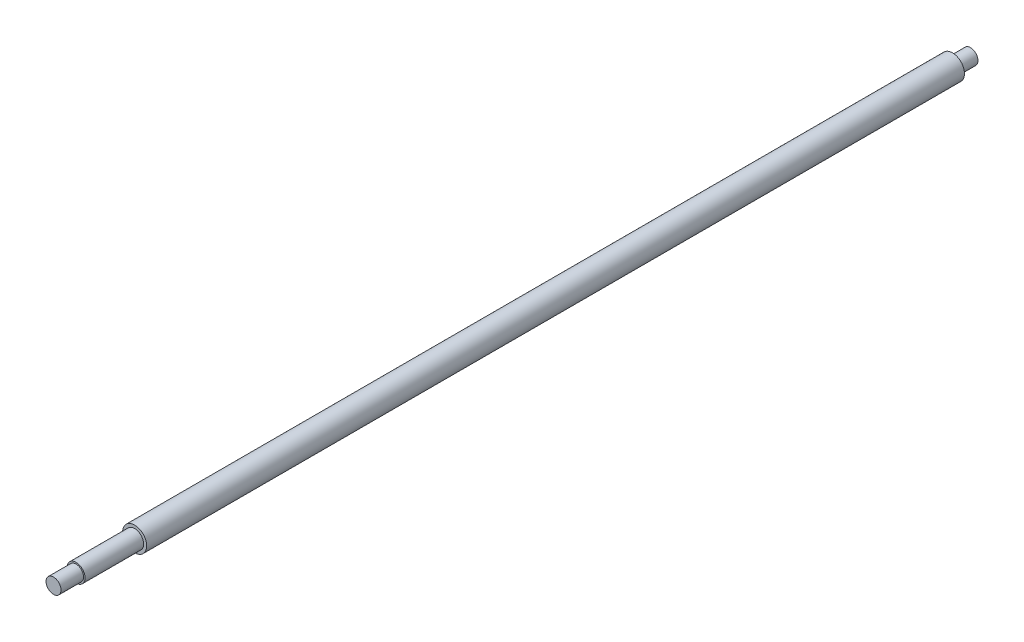
ISO-10303-21;
HEADER;
FILE_DESCRIPTION(('STEP AP214'),'2;1');
FILE_NAME('part.step','',(''),(''),'','','');
FILE_SCHEMA(('AUTOMOTIVE_DESIGN { 1 0 10303 214 1 1 1 1 }'));
ENDSEC;
DATA;
#1=APPLICATION_CONTEXT('core data for automotive mechanical design processes');
#2=APPLICATION_PROTOCOL_DEFINITION('international standard','automotive_design',2000,#1);
#3=PRODUCT_CONTEXT('',#1,'mechanical');
#4=PRODUCT('Part','Part','',(#3));
#5=PRODUCT_RELATED_PRODUCT_CATEGORY('part','',(#4));
#6=PRODUCT_DEFINITION_FORMATION('','',#4);
#7=PRODUCT_DEFINITION_CONTEXT('part definition',#1,'design');
#8=PRODUCT_DEFINITION('design','',#6,#7);
#9=PRODUCT_DEFINITION_SHAPE('','',#8);
#10=(LENGTH_UNIT() NAMED_UNIT(*) SI_UNIT(.MILLI.,.METRE.));
#11=(NAMED_UNIT(*) PLANE_ANGLE_UNIT() SI_UNIT($,.RADIAN.));
#12=(NAMED_UNIT(*) SI_UNIT($,.STERADIAN.) SOLID_ANGLE_UNIT());
#13=UNCERTAINTY_MEASURE_WITH_UNIT(LENGTH_MEASURE(1.E-05),#10,'distance_accuracy_value','');
#14=(GEOMETRIC_REPRESENTATION_CONTEXT(3) GLOBAL_UNCERTAINTY_ASSIGNED_CONTEXT((#13)) GLOBAL_UNIT_ASSIGNED_CONTEXT((#10,
#11,#12)) REPRESENTATION_CONTEXT('',''));
#15=CARTESIAN_POINT('',(0.,0.,0.));
#16=DIRECTION('',(0.,0.,1.));
#17=DIRECTION('',(1.,0.,0.));
#18=AXIS2_PLACEMENT_3D('',#15,#16,#17);
#19=CARTESIAN_POINT('',(0.,0.,610.5));
#20=DIRECTION('',(0.,0.,1.));
#21=DIRECTION('',(1.,0.,0.));
#22=AXIS2_PLACEMENT_3D('',#19,#20,#21);
#23=PLANE('',#22);
#24=CARTESIAN_POINT('',(0.,0.,610.5));
#25=DIRECTION('',(0.,0.,-1.));
#26=DIRECTION('',(-1.,0.,0.));
#27=AXIS2_PLACEMENT_3D('',#24,#25,#26);
#28=CIRCLE('',#27,4.99999999999994);
#29=CARTESIAN_POINT('',(-4.99999999999994,0.,610.5));
#30=VERTEX_POINT('',#29);
#31=EDGE_CURVE('E10',#30,#30,#28,.T.);
#32=ORIENTED_EDGE('',*,*,#31,.F.);
#33=EDGE_LOOP('',(#32));
#34=FACE_BOUND('',#33,.T.);
#35=ADVANCED_FACE('F34',(#34),#23,.T.);
#36=CARTESIAN_POINT('',(0.,0.,0.));
#37=DIRECTION('',(0.,0.,-1.));
#38=DIRECTION('',(-1.,0.,0.));
#39=AXIS2_PLACEMENT_3D('',#36,#37,#38);
#40=CYLINDRICAL_SURFACE('',#39,4.99999999999994);
#41=ORIENTED_EDGE('',*,*,#31,.T.);
#42=EDGE_LOOP('',(#41));
#43=FACE_BOUND('',#42,.T.);
#44=CARTESIAN_POINT('',(0.,0.,595.5));
#45=DIRECTION('',(0.,0.,-1.));
#46=DIRECTION('',(-1.,0.,0.));
#47=AXIS2_PLACEMENT_3D('',#44,#45,#46);
#48=CIRCLE('',#47,4.99999999999994);
#49=CARTESIAN_POINT('',(-4.99999999999994,0.,595.5));
#50=VERTEX_POINT('',#49);
#51=EDGE_CURVE('E40',#50,#50,#48,.T.);
#52=ORIENTED_EDGE('',*,*,#51,.F.);
#53=EDGE_LOOP('',(#52));
#54=FACE_BOUND('',#53,.T.);
#55=ADVANCED_FACE('F82',(#43,#54),#40,.T.);
#56=CARTESIAN_POINT('',(0.,4.99999999999994,595.5));
#57=DIRECTION('',(0.,0.,1.));
#58=DIRECTION('',(1.,0.,0.));
#59=AXIS2_PLACEMENT_3D('',#56,#57,#58);
#60=PLANE('',#59);
#61=ORIENTED_EDGE('',*,*,#51,.T.);
#62=EDGE_LOOP('',(#61));
#63=FACE_BOUND('',#62,.T.);
#64=CARTESIAN_POINT('',(0.,0.,595.5));
#65=DIRECTION('',(0.,0.,-1.));
#66=DIRECTION('',(-1.,0.,0.));
#67=AXIS2_PLACEMENT_3D('',#64,#65,#66);
#68=CIRCLE('',#67,5.99999999999994);
#69=CARTESIAN_POINT('',(-5.99999999999994,0.,595.5));
#70=VERTEX_POINT('',#69);
#71=EDGE_CURVE('E44',#70,#70,#68,.T.);
#72=ORIENTED_EDGE('',*,*,#71,.F.);
#73=EDGE_LOOP('',(#72));
#74=FACE_BOUND('',#73,.T.);
#75=ADVANCED_FACE('F87',(#63,#74),#60,.T.);
#76=CARTESIAN_POINT('',(0.,0.,0.));
#77=DIRECTION('',(0.,0.,-1.));
#78=DIRECTION('',(-1.,0.,0.));
#79=AXIS2_PLACEMENT_3D('',#76,#77,#78);
#80=CYLINDRICAL_SURFACE('',#79,5.99999999999994);
#81=ORIENTED_EDGE('',*,*,#71,.T.);
#82=EDGE_LOOP('',(#81));
#83=FACE_BOUND('',#82,.T.);
#84=CARTESIAN_POINT('',(0.,0.,556.5));
#85=DIRECTION('',(0.,0.,-1.));
#86=DIRECTION('',(-1.,0.,0.));
#87=AXIS2_PLACEMENT_3D('',#84,#85,#86);
#88=CIRCLE('',#87,5.99999999999994);
#89=CARTESIAN_POINT('',(-5.99999999999994,0.,556.5));
#90=VERTEX_POINT('',#89);
#91=EDGE_CURVE('E48',#90,#90,#88,.T.);
#92=ORIENTED_EDGE('',*,*,#91,.F.);
#93=EDGE_LOOP('',(#92));
#94=FACE_BOUND('',#93,.T.);
#95=ADVANCED_FACE('F91',(#83,#94),#80,.T.);
#96=CARTESIAN_POINT('',(0.,5.99999999999994,556.5));
#97=DIRECTION('',(0.,0.,1.));
#98=DIRECTION('',(1.,0.,0.));
#99=AXIS2_PLACEMENT_3D('',#96,#97,#98);
#100=PLANE('',#99);
#101=ORIENTED_EDGE('',*,*,#91,.T.);
#102=EDGE_LOOP('',(#101));
#103=FACE_BOUND('',#102,.T.);
#104=CARTESIAN_POINT('',(0.,0.,556.5));
#105=DIRECTION('',(0.,0.,-1.));
#106=DIRECTION('',(-1.,0.,0.));
#107=AXIS2_PLACEMENT_3D('',#104,#105,#106);
#108=CIRCLE('',#107,7.99999999999995);
#109=CARTESIAN_POINT('',(-7.99999999999995,0.,556.5));
#110=VERTEX_POINT('',#109);
#111=EDGE_CURVE('E53',#110,#110,#108,.T.);
#112=ORIENTED_EDGE('',*,*,#111,.F.);
#113=EDGE_LOOP('',(#112));
#114=FACE_BOUND('',#113,.T.);
#115=ADVANCED_FACE('F97',(#103,#114),#100,.T.);
#116=CARTESIAN_POINT('',(0.,0.,0.));
#117=DIRECTION('',(0.,0.,-1.));
#118=DIRECTION('',(-1.,0.,0.));
#119=AXIS2_PLACEMENT_3D('',#116,#117,#118);
#120=CYLINDRICAL_SURFACE('',#119,7.99999999999997);
#121=ORIENTED_EDGE('',*,*,#111,.T.);
#122=EDGE_LOOP('',(#121));
#123=FACE_BOUND('',#122,.T.);
#124=CARTESIAN_POINT('',(0.,0.,12.));
#125=DIRECTION('',(0.,0.,-1.));
#126=DIRECTION('',(-1.,0.,0.));
#127=AXIS2_PLACEMENT_3D('',#124,#125,#126);
#128=CIRCLE('',#127,7.99999999999999);
#129=CARTESIAN_POINT('',(-7.99999999999999,0.,12.));
#130=VERTEX_POINT('',#129);
#131=EDGE_CURVE('E56',#130,#130,#128,.T.);
#132=ORIENTED_EDGE('',*,*,#131,.F.);
#133=EDGE_LOOP('',(#132));
#134=FACE_BOUND('',#133,.T.);
#135=ADVANCED_FACE('F78',(#123,#134),#120,.T.);
#136=CARTESIAN_POINT('',(0.,7.99999999999999,12.));
#137=DIRECTION('',(0.,0.,-1.));
#138=DIRECTION('',(-1.,0.,0.));
#139=AXIS2_PLACEMENT_3D('',#136,#137,#138);
#140=PLANE('',#139);
#141=ORIENTED_EDGE('',*,*,#131,.T.);
#142=EDGE_LOOP('',(#141));
#143=FACE_BOUND('',#142,.T.);
#144=CARTESIAN_POINT('',(0.,0.,12.));
#145=DIRECTION('',(0.,0.,-1.));
#146=DIRECTION('',(-1.,0.,0.));
#147=AXIS2_PLACEMENT_3D('',#144,#145,#146);
#148=CIRCLE('',#147,5.);
#149=CARTESIAN_POINT('',(-5.,0.,12.));
#150=VERTEX_POINT('',#149);
#151=EDGE_CURVE('E59',#150,#150,#148,.T.);
#152=ORIENTED_EDGE('',*,*,#151,.F.);
#153=EDGE_LOOP('',(#152));
#154=FACE_BOUND('',#153,.T.);
#155=ADVANCED_FACE('F70',(#143,#154),#140,.T.);
#156=CARTESIAN_POINT('',(0.,0.,0.));
#157=DIRECTION('',(0.,0.,-1.));
#158=DIRECTION('',(-1.,0.,0.));
#159=AXIS2_PLACEMENT_3D('',#156,#157,#158);
#160=CYLINDRICAL_SURFACE('',#159,5.);
#161=ORIENTED_EDGE('',*,*,#151,.T.);
#162=EDGE_LOOP('',(#161));
#163=FACE_BOUND('',#162,.T.);
#164=CARTESIAN_POINT('',(0.,0.,0.));
#165=DIRECTION('',(0.,0.,-1.));
#166=DIRECTION('',(-1.,0.,0.));
#167=AXIS2_PLACEMENT_3D('',#164,#165,#166);
#168=CIRCLE('',#167,5.);
#169=CARTESIAN_POINT('',(-5.,0.,0.));
#170=VERTEX_POINT('',#169);
#171=EDGE_CURVE('E62',#170,#170,#168,.T.);
#172=ORIENTED_EDGE('',*,*,#171,.F.);
#173=EDGE_LOOP('',(#172));
#174=FACE_BOUND('',#173,.T.);
#175=ADVANCED_FACE('F68',(#163,#174),#160,.T.);
#176=CARTESIAN_POINT('',(0.,5.,0.));
#177=DIRECTION('',(0.,0.,-1.));
#178=DIRECTION('',(-1.,0.,0.));
#179=AXIS2_PLACEMENT_3D('',#176,#177,#178);
#180=PLANE('',#179);
#181=ORIENTED_EDGE('',*,*,#171,.T.);
#182=EDGE_LOOP('',(#181));
#183=FACE_BOUND('',#182,.T.);
#184=ADVANCED_FACE('F66',(#183),#180,.T.);
#185=CLOSED_SHELL('',(#35,#55,#75,#95,#115,#135,#155,#175,#184));
#186=MANIFOLD_SOLID_BREP('B2',#185);
#187=ADVANCED_BREP_SHAPE_REPRESENTATION('',(#18,#186),#14);
#188=SHAPE_DEFINITION_REPRESENTATION(#9,#187);
ENDSEC;
END-ISO-10303-21;
